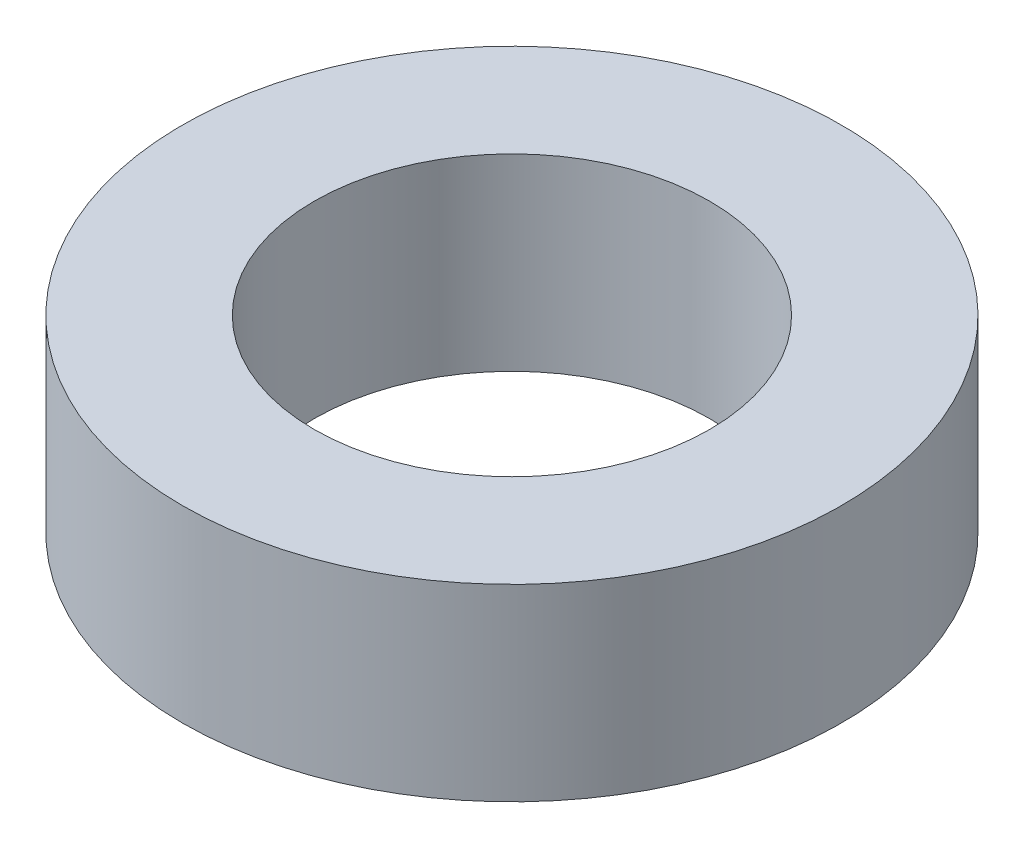
ISO-10303-21;
HEADER;
FILE_DESCRIPTION(('STEP AP214'),'2;1');
FILE_NAME('part.step','',(''),(''),'','','');
FILE_SCHEMA(('AUTOMOTIVE_DESIGN { 1 0 10303 214 1 1 1 1 }'));
ENDSEC;
DATA;
#1=APPLICATION_CONTEXT('core data for automotive mechanical design processes');
#2=APPLICATION_PROTOCOL_DEFINITION('international standard','automotive_design',2000,#1);
#3=PRODUCT_CONTEXT('',#1,'mechanical');
#4=PRODUCT('Part','Part','',(#3));
#5=PRODUCT_RELATED_PRODUCT_CATEGORY('part','',(#4));
#6=PRODUCT_DEFINITION_FORMATION('','',#4);
#7=PRODUCT_DEFINITION_CONTEXT('part definition',#1,'design');
#8=PRODUCT_DEFINITION('design','',#6,#7);
#9=PRODUCT_DEFINITION_SHAPE('','',#8);
#10=(LENGTH_UNIT() NAMED_UNIT(*) SI_UNIT(.MILLI.,.METRE.));
#11=(NAMED_UNIT(*) PLANE_ANGLE_UNIT() SI_UNIT($,.RADIAN.));
#12=(NAMED_UNIT(*) SI_UNIT($,.STERADIAN.) SOLID_ANGLE_UNIT());
#13=UNCERTAINTY_MEASURE_WITH_UNIT(LENGTH_MEASURE(1.E-05),#10,'distance_accuracy_value','');
#14=(GEOMETRIC_REPRESENTATION_CONTEXT(3) GLOBAL_UNCERTAINTY_ASSIGNED_CONTEXT((#13)) GLOBAL_UNIT_ASSIGNED_CONTEXT((#10,
#11,#12)) REPRESENTATION_CONTEXT('',''));
#15=CARTESIAN_POINT('',(0.,0.,0.));
#16=DIRECTION('',(0.,0.,1.));
#17=DIRECTION('',(1.,0.,0.));
#18=AXIS2_PLACEMENT_3D('',#15,#16,#17);
#19=CARTESIAN_POINT('',(0.,2.,0.));
#20=DIRECTION('',(0.,1.,0.));
#21=DIRECTION('',(0.,0.,1.));
#22=AXIS2_PLACEMENT_3D('',#19,#20,#21);
#23=PLANE('',#22);
#24=CARTESIAN_POINT('',(0.,2.,0.));
#25=DIRECTION('',(0.,1.,0.));
#26=DIRECTION('',(0.,0.,1.));
#27=AXIS2_PLACEMENT_3D('',#24,#25,#26);
#28=CIRCLE('',#27,3.5);
#29=CARTESIAN_POINT('',(0.,2.,3.5));
#30=VERTEX_POINT('',#29);
#31=EDGE_CURVE('E10',#30,#30,#28,.T.);
#32=ORIENTED_EDGE('',*,*,#31,.T.);
#33=EDGE_LOOP('',(#32));
#34=FACE_BOUND('',#33,.T.);
#35=CARTESIAN_POINT('',(0.,2.,0.));
#36=DIRECTION('',(0.,1.,0.));
#37=DIRECTION('',(0.,0.,1.));
#38=AXIS2_PLACEMENT_3D('',#35,#36,#37);
#39=CIRCLE('',#38,2.1);
#40=CARTESIAN_POINT('',(0.,2.,2.1));
#41=VERTEX_POINT('',#40);
#42=EDGE_CURVE('E44',#41,#41,#39,.T.);
#43=ORIENTED_EDGE('',*,*,#42,.F.);
#44=EDGE_LOOP('',(#43));
#45=FACE_BOUND('',#44,.T.);
#46=ADVANCED_FACE('F33',(#34,#45),#23,.T.);
#47=CARTESIAN_POINT('',(0.,0.,0.));
#48=DIRECTION('',(0.,1.,0.));
#49=DIRECTION('',(0.,0.,1.));
#50=AXIS2_PLACEMENT_3D('',#47,#48,#49);
#51=PLANE('',#50);
#52=CARTESIAN_POINT('',(0.,0.,0.));
#53=DIRECTION('',(0.,1.,0.));
#54=DIRECTION('',(0.,0.,1.));
#55=AXIS2_PLACEMENT_3D('',#52,#53,#54);
#56=CIRCLE('',#55,3.5);
#57=CARTESIAN_POINT('',(0.,0.,3.5));
#58=VERTEX_POINT('',#57);
#59=EDGE_CURVE('E37',#58,#58,#56,.T.);
#60=ORIENTED_EDGE('',*,*,#59,.F.);
#61=EDGE_LOOP('',(#60));
#62=FACE_BOUND('',#61,.T.);
#63=CARTESIAN_POINT('',(0.,0.,0.));
#64=DIRECTION('',(0.,1.,0.));
#65=DIRECTION('',(0.,0.,1.));
#66=AXIS2_PLACEMENT_3D('',#63,#64,#65);
#67=CIRCLE('',#66,2.1);
#68=CARTESIAN_POINT('',(0.,0.,2.1));
#69=VERTEX_POINT('',#68);
#70=EDGE_CURVE('E46',#69,#69,#67,.T.);
#71=ORIENTED_EDGE('',*,*,#70,.T.);
#72=EDGE_LOOP('',(#71));
#73=FACE_BOUND('',#72,.T.);
#74=ADVANCED_FACE('F56',(#62,#73),#51,.F.);
#75=CARTESIAN_POINT('',(0.,2.,0.));
#76=DIRECTION('',(0.,-1.,0.));
#77=DIRECTION('',(0.,0.,-1.));
#78=AXIS2_PLACEMENT_3D('',#75,#76,#77);
#79=CYLINDRICAL_SURFACE('',#78,3.5);
#80=ORIENTED_EDGE('',*,*,#31,.F.);
#81=EDGE_LOOP('',(#80));
#82=FACE_BOUND('',#81,.T.);
#83=ORIENTED_EDGE('',*,*,#59,.T.);
#84=EDGE_LOOP('',(#83));
#85=FACE_BOUND('',#84,.T.);
#86=ADVANCED_FACE('F35',(#82,#85),#79,.T.);
#87=CARTESIAN_POINT('',(0.,2.,0.));
#88=DIRECTION('',(0.,-1.,0.));
#89=DIRECTION('',(0.,0.,-1.));
#90=AXIS2_PLACEMENT_3D('',#87,#88,#89);
#91=CYLINDRICAL_SURFACE('',#90,2.1);
#92=ORIENTED_EDGE('',*,*,#42,.T.);
#93=EDGE_LOOP('',(#92));
#94=FACE_BOUND('',#93,.T.);
#95=ORIENTED_EDGE('',*,*,#70,.F.);
#96=EDGE_LOOP('',(#95));
#97=FACE_BOUND('',#96,.T.);
#98=ADVANCED_FACE('F52',(#94,#97),#91,.F.);
#99=CLOSED_SHELL('',(#46,#74,#86,#98));
#100=MANIFOLD_SOLID_BREP('B2',#99);
#101=ADVANCED_BREP_SHAPE_REPRESENTATION('',(#18,#100),#14);
#102=SHAPE_DEFINITION_REPRESENTATION(#9,#101);
ENDSEC;
END-ISO-10303-21;
